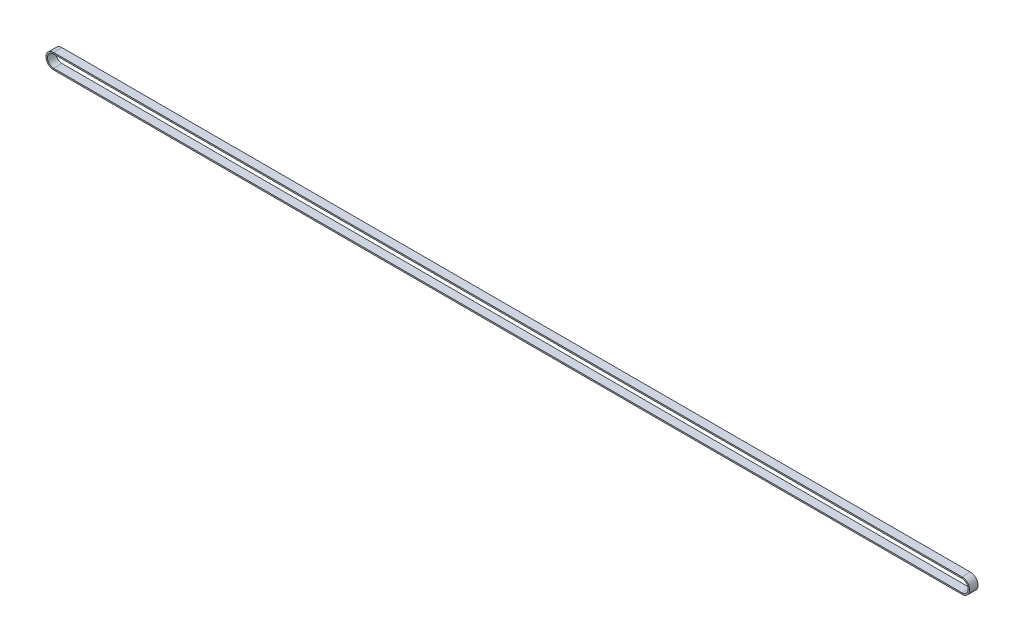
ISO-10303-21;
HEADER;
FILE_DESCRIPTION(('STEP AP214'),'2;1');
FILE_NAME('part.step','',(''),(''),'','','');
FILE_SCHEMA(('AUTOMOTIVE_DESIGN { 1 0 10303 214 1 1 1 1 }'));
ENDSEC;
DATA;
#1=APPLICATION_CONTEXT('core data for automotive mechanical design processes');
#2=APPLICATION_PROTOCOL_DEFINITION('international standard','automotive_design',2000,#1);
#3=PRODUCT_CONTEXT('',#1,'mechanical');
#4=PRODUCT('Part','Part','',(#3));
#5=PRODUCT_RELATED_PRODUCT_CATEGORY('part','',(#4));
#6=PRODUCT_DEFINITION_FORMATION('','',#4);
#7=PRODUCT_DEFINITION_CONTEXT('part definition',#1,'design');
#8=PRODUCT_DEFINITION('design','',#6,#7);
#9=PRODUCT_DEFINITION_SHAPE('','',#8);
#10=(LENGTH_UNIT() NAMED_UNIT(*) SI_UNIT(.MILLI.,.METRE.));
#11=(NAMED_UNIT(*) PLANE_ANGLE_UNIT() SI_UNIT($,.RADIAN.));
#12=(NAMED_UNIT(*) SI_UNIT($,.STERADIAN.) SOLID_ANGLE_UNIT());
#13=UNCERTAINTY_MEASURE_WITH_UNIT(LENGTH_MEASURE(1.E-05),#10,'distance_accuracy_value','');
#14=(GEOMETRIC_REPRESENTATION_CONTEXT(3) GLOBAL_UNCERTAINTY_ASSIGNED_CONTEXT((#13)) GLOBAL_UNIT_ASSIGNED_CONTEXT((#10,
#11,#12)) REPRESENTATION_CONTEXT('',''));
#15=CARTESIAN_POINT('',(0.,0.,0.));
#16=DIRECTION('',(0.,0.,1.));
#17=DIRECTION('',(1.,0.,0.));
#18=AXIS2_PLACEMENT_3D('',#15,#16,#17);
#19=CARTESIAN_POINT('',(-343.463325094612,-1403.78313649822,0.));
#20=DIRECTION('',(0.,-1.,0.));
#21=DIRECTION('',(0.,0.,-1.));
#22=AXIS2_PLACEMENT_3D('',#19,#20,#21);
#23=PLANE('',#22);
#24=DIRECTION('',(1.,0.,0.));
#25=VECTOR('',#24,1.);
#26=CARTESIAN_POINT('',(-343.463325094612,-1403.78313649822,0.));
#27=LINE('',#26,#25);
#28=CARTESIAN_POINT('',(-343.463325094708,-1403.78313649826,0.));
#29=VERTEX_POINT('',#28);
#30=CARTESIAN_POINT('',(632.867575204299,-1403.78313649826,0.));
#31=VERTEX_POINT('',#30);
#32=EDGE_CURVE('E11',#29,#31,#27,.T.);
#33=ORIENTED_EDGE('',*,*,#32,.F.);
#34=DIRECTION('',(0.,0.,-1.));
#35=VECTOR('',#34,1.);
#36=CARTESIAN_POINT('',(-343.463325094708,-1403.78313649826,0.));
#37=LINE('',#36,#35);
#38=CARTESIAN_POINT('',(-343.463325094708,-1403.78313649826,-9.));
#39=VERTEX_POINT('',#38);
#40=EDGE_CURVE('E38',#29,#39,#37,.T.);
#41=ORIENTED_EDGE('',*,*,#40,.T.);
#42=DIRECTION('',(1.,0.,0.));
#43=VECTOR('',#42,1.);
#44=CARTESIAN_POINT('',(-343.463325094612,-1403.78313649822,-9.));
#45=LINE('',#44,#43);
#46=CARTESIAN_POINT('',(632.867575204299,-1403.78313649826,-9.));
#47=VERTEX_POINT('',#46);
#48=EDGE_CURVE('E123',#39,#47,#45,.T.);
#49=ORIENTED_EDGE('',*,*,#48,.T.);
#50=DIRECTION('',(0.,0.,-1.));
#51=VECTOR('',#50,1.);
#52=CARTESIAN_POINT('',(632.867575204299,-1403.78313649826,0.));
#53=LINE('',#52,#51);
#54=EDGE_CURVE('E126',#31,#47,#53,.T.);
#55=ORIENTED_EDGE('',*,*,#54,.F.);
#56=EDGE_LOOP('',(#33,#41,#49,#55));
#57=FACE_BOUND('',#56,.T.);
#58=ADVANCED_FACE('F35',(#57),#23,.T.);
#59=CARTESIAN_POINT('',(-343.463325094612,-1403.78313649822,0.));
#60=DIRECTION('',(0.,0.,1.));
#61=DIRECTION('',(1.,0.,0.));
#62=AXIS2_PLACEMENT_3D('',#59,#60,#61);
#63=PLANE('',#62);
#64=DIRECTION('',(1.,0.,0.));
#65=VECTOR('',#64,1.);
#66=CARTESIAN_POINT('',(-343.463325094612,-1402.28313649822,0.));
#67=LINE('',#66,#65);
#68=CARTESIAN_POINT('',(-343.463325094708,-1402.28313649826,0.));
#69=VERTEX_POINT('',#68);
#70=CARTESIAN_POINT('',(632.867575204299,-1402.28313649826,0.));
#71=VERTEX_POINT('',#70);
#72=EDGE_CURVE('E43',#69,#71,#67,.T.);
#73=ORIENTED_EDGE('',*,*,#72,.F.);
#74=DIRECTION('',(0.,-1.,0.));
#75=VECTOR('',#74,1.);
#76=CARTESIAN_POINT('',(-343.463325094708,-1403.78313649826,0.));
#77=LINE('',#76,#75);
#78=EDGE_CURVE('E193',#69,#29,#77,.T.);
#79=ORIENTED_EDGE('',*,*,#78,.T.);
#80=ORIENTED_EDGE('',*,*,#32,.T.);
#81=DIRECTION('',(0.,-1.,0.));
#82=VECTOR('',#81,1.);
#83=CARTESIAN_POINT('',(632.867575204299,-1403.78313649826,0.));
#84=LINE('',#83,#82);
#85=EDGE_CURVE('E151',#71,#31,#84,.T.);
#86=ORIENTED_EDGE('',*,*,#85,.F.);
#87=EDGE_LOOP('',(#73,#79,#80,#86));
#88=FACE_BOUND('',#87,.T.);
#89=ADVANCED_FACE('F217',(#88),#63,.T.);
#90=CARTESIAN_POINT('',(-343.463325094612,-1402.28313649822,0.));
#91=DIRECTION('',(0.,1.,0.));
#92=DIRECTION('',(0.,0.,1.));
#93=AXIS2_PLACEMENT_3D('',#90,#91,#92);
#94=PLANE('',#93);
#95=DIRECTION('',(1.,0.,0.));
#96=VECTOR('',#95,1.);
#97=CARTESIAN_POINT('',(-343.463325094612,-1402.28313649822,-9.));
#98=LINE('',#97,#96);
#99=CARTESIAN_POINT('',(-343.463325094708,-1402.28313649826,-9.));
#100=VERTEX_POINT('',#99);
#101=CARTESIAN_POINT('',(632.867575204299,-1402.28313649826,-9.));
#102=VERTEX_POINT('',#101);
#103=EDGE_CURVE('E132',#100,#102,#98,.T.);
#104=ORIENTED_EDGE('',*,*,#103,.F.);
#105=DIRECTION('',(0.,0.,1.));
#106=VECTOR('',#105,1.);
#107=CARTESIAN_POINT('',(-343.463325094708,-1402.28313649826,0.));
#108=LINE('',#107,#106);
#109=EDGE_CURVE('E177',#100,#69,#108,.T.);
#110=ORIENTED_EDGE('',*,*,#109,.T.);
#111=ORIENTED_EDGE('',*,*,#72,.T.);
#112=DIRECTION('',(0.,0.,1.));
#113=VECTOR('',#112,1.);
#114=CARTESIAN_POINT('',(632.867575204299,-1402.28313649826,0.));
#115=LINE('',#114,#113);
#116=EDGE_CURVE('E155',#102,#71,#115,.T.);
#117=ORIENTED_EDGE('',*,*,#116,.F.);
#118=EDGE_LOOP('',(#104,#110,#111,#117));
#119=FACE_BOUND('',#118,.T.);
#120=ADVANCED_FACE('F222',(#119),#94,.T.);
#121=CARTESIAN_POINT('',(-343.463325094707,-1410.42288649826,0.));
#122=DIRECTION('',(0.,0.,-1.));
#123=DIRECTION('',(-1.,0.,0.));
#124=AXIS2_PLACEMENT_3D('',#121,#122,#123);
#125=CYLINDRICAL_SURFACE('',#124,6.63974999999994);
#126=ORIENTED_EDGE('',*,*,#40,.F.);
#127=CARTESIAN_POINT('',(-343.463325094707,-1410.42288649826,0.));
#128=DIRECTION('',(0.,0.,-1.));
#129=DIRECTION('',(0.,-1.,0.));
#130=AXIS2_PLACEMENT_3D('',#127,#128,#129);
#131=CIRCLE('',#130,6.63974999999994);
#132=CARTESIAN_POINT('',(-343.463325094707,-1417.06263649826,0.));
#133=VERTEX_POINT('',#132);
#134=EDGE_CURVE('E79',#133,#29,#131,.T.);
#135=ORIENTED_EDGE('',*,*,#134,.F.);
#136=DIRECTION('',(0.,0.,-1.));
#137=VECTOR('',#136,1.);
#138=CARTESIAN_POINT('',(-343.463325094707,-1417.06263649826,0.));
#139=LINE('',#138,#137);
#140=CARTESIAN_POINT('',(-343.463325094707,-1417.06263649826,-9.));
#141=VERTEX_POINT('',#140);
#142=EDGE_CURVE('E180',#133,#141,#139,.T.);
#143=ORIENTED_EDGE('',*,*,#142,.T.);
#144=CARTESIAN_POINT('',(-343.463325094707,-1410.42288649826,-9.));
#145=DIRECTION('',(0.,0.,-1.));
#146=DIRECTION('',(0.,-1.,0.));
#147=AXIS2_PLACEMENT_3D('',#144,#145,#146);
#148=CIRCLE('',#147,6.63974999999994);
#149=EDGE_CURVE('E175',#141,#39,#148,.T.);
#150=ORIENTED_EDGE('',*,*,#149,.T.);
#151=EDGE_LOOP('',(#126,#135,#143,#150));
#152=FACE_BOUND('',#151,.T.);
#153=ADVANCED_FACE('F206',(#152),#125,.F.);
#154=CARTESIAN_POINT('',(-343.463325094707,-1417.06263649826,0.));
#155=DIRECTION('',(0.,0.,1.));
#156=DIRECTION('',(1.,0.,0.));
#157=AXIS2_PLACEMENT_3D('',#154,#155,#156);
#158=PLANE('',#157);
#159=ORIENTED_EDGE('',*,*,#134,.T.);
#160=ORIENTED_EDGE('',*,*,#78,.F.);
#161=CARTESIAN_POINT('',(-343.463325094707,-1410.42288649826,0.));
#162=DIRECTION('',(0.,0.,-1.));
#163=DIRECTION('',(0.,-1.,0.));
#164=AXIS2_PLACEMENT_3D('',#161,#162,#163);
#165=CIRCLE('',#164,8.13975);
#166=CARTESIAN_POINT('',(-343.463325094707,-1418.56263649826,0.));
#167=VERTEX_POINT('',#166);
#168=EDGE_CURVE('E88',#167,#69,#165,.T.);
#169=ORIENTED_EDGE('',*,*,#168,.F.);
#170=DIRECTION('',(0.,1.,0.));
#171=VECTOR('',#170,1.);
#172=CARTESIAN_POINT('',(-343.463325094707,-1417.06263649826,0.));
#173=LINE('',#172,#171);
#174=EDGE_CURVE('E189',#167,#133,#173,.T.);
#175=ORIENTED_EDGE('',*,*,#174,.T.);
#176=EDGE_LOOP('',(#159,#160,#169,#175));
#177=FACE_BOUND('',#176,.T.);
#178=ADVANCED_FACE('F216',(#177),#158,.T.);
#179=CARTESIAN_POINT('',(-343.463325094707,-1410.42288649826,0.));
#180=DIRECTION('',(0.,0.,-1.));
#181=DIRECTION('',(-1.,0.,0.));
#182=AXIS2_PLACEMENT_3D('',#179,#180,#181);
#183=CYLINDRICAL_SURFACE('',#182,8.13975);
#184=ORIENTED_EDGE('',*,*,#168,.T.);
#185=ORIENTED_EDGE('',*,*,#109,.F.);
#186=CARTESIAN_POINT('',(-343.463325094707,-1410.42288649826,-9.));
#187=DIRECTION('',(0.,0.,-1.));
#188=DIRECTION('',(0.,-1.,0.));
#189=AXIS2_PLACEMENT_3D('',#186,#187,#188);
#190=CIRCLE('',#189,8.13975);
#191=CARTESIAN_POINT('',(-343.463325094707,-1418.56263649826,-9.));
#192=VERTEX_POINT('',#191);
#193=EDGE_CURVE('E96',#192,#100,#190,.T.);
#194=ORIENTED_EDGE('',*,*,#193,.F.);
#195=DIRECTION('',(0.,0.,1.));
#196=VECTOR('',#195,1.);
#197=CARTESIAN_POINT('',(-343.463325094707,-1418.56263649826,0.));
#198=LINE('',#197,#196);
#199=EDGE_CURVE('E169',#192,#167,#198,.T.);
#200=ORIENTED_EDGE('',*,*,#199,.T.);
#201=EDGE_LOOP('',(#184,#185,#194,#200));
#202=FACE_BOUND('',#201,.T.);
#203=ADVANCED_FACE('F223',(#202),#183,.T.);
#204=CARTESIAN_POINT('',(-343.463325094707,-1417.06263649826,-9.));
#205=DIRECTION('',(0.,0.,-1.));
#206=DIRECTION('',(-1.,0.,0.));
#207=AXIS2_PLACEMENT_3D('',#204,#205,#206);
#208=PLANE('',#207);
#209=ORIENTED_EDGE('',*,*,#193,.T.);
#210=DIRECTION('',(0.,1.,0.));
#211=VECTOR('',#210,1.);
#212=CARTESIAN_POINT('',(-343.463325094708,-1403.78313649826,-9.));
#213=LINE('',#212,#211);
#214=EDGE_CURVE('E173',#39,#100,#213,.T.);
#215=ORIENTED_EDGE('',*,*,#214,.F.);
#216=ORIENTED_EDGE('',*,*,#149,.F.);
#217=DIRECTION('',(0.,-1.,0.));
#218=VECTOR('',#217,1.);
#219=CARTESIAN_POINT('',(-343.463325094707,-1417.06263649826,-9.));
#220=LINE('',#219,#218);
#221=EDGE_CURVE('E164',#141,#192,#220,.T.);
#222=ORIENTED_EDGE('',*,*,#221,.T.);
#223=EDGE_LOOP('',(#209,#215,#216,#222));
#224=FACE_BOUND('',#223,.T.);
#225=ADVANCED_FACE('F224',(#224),#208,.T.);
#226=CARTESIAN_POINT('',(632.8675752043,-1417.06263649826,0.));
#227=DIRECTION('',(0.,1.,0.));
#228=DIRECTION('',(0.,0.,1.));
#229=AXIS2_PLACEMENT_3D('',#226,#227,#228);
#230=PLANE('',#229);
#231=ORIENTED_EDGE('',*,*,#142,.F.);
#232=DIRECTION('',(-1.,0.,0.));
#233=VECTOR('',#232,1.);
#234=CARTESIAN_POINT('',(632.8675752043,-1417.06263649826,0.));
#235=LINE('',#234,#233);
#236=CARTESIAN_POINT('',(632.8675752043,-1417.06263649826,0.));
#237=VERTEX_POINT('',#236);
#238=EDGE_CURVE('E199',#237,#133,#235,.T.);
#239=ORIENTED_EDGE('',*,*,#238,.F.);
#240=DIRECTION('',(0.,0.,-1.));
#241=VECTOR('',#240,1.);
#242=CARTESIAN_POINT('',(632.8675752043,-1417.06263649826,0.));
#243=LINE('',#242,#241);
#244=CARTESIAN_POINT('',(632.8675752043,-1417.06263649826,-9.));
#245=VERTEX_POINT('',#244);
#246=EDGE_CURVE('E172',#237,#245,#243,.T.);
#247=ORIENTED_EDGE('',*,*,#246,.T.);
#248=DIRECTION('',(-1.,0.,0.));
#249=VECTOR('',#248,1.);
#250=CARTESIAN_POINT('',(632.8675752043,-1417.06263649826,-9.));
#251=LINE('',#250,#249);
#252=EDGE_CURVE('E167',#245,#141,#251,.T.);
#253=ORIENTED_EDGE('',*,*,#252,.T.);
#254=EDGE_LOOP('',(#231,#239,#247,#253));
#255=FACE_BOUND('',#254,.T.);
#256=ADVANCED_FACE('F211',(#255),#230,.T.);
#257=CARTESIAN_POINT('',(632.8675752043,-1417.06263649826,0.));
#258=DIRECTION('',(0.,0.,1.));
#259=DIRECTION('',(1.,0.,0.));
#260=AXIS2_PLACEMENT_3D('',#257,#258,#259);
#261=PLANE('',#260);
#262=ORIENTED_EDGE('',*,*,#238,.T.);
#263=ORIENTED_EDGE('',*,*,#174,.F.);
#264=DIRECTION('',(-1.,0.,0.));
#265=VECTOR('',#264,1.);
#266=CARTESIAN_POINT('',(632.8675752043,-1418.56263649826,0.));
#267=LINE('',#266,#265);
#268=CARTESIAN_POINT('',(632.8675752043,-1418.56263649826,0.));
#269=VERTEX_POINT('',#268);
#270=EDGE_CURVE('E108',#269,#167,#267,.T.);
#271=ORIENTED_EDGE('',*,*,#270,.F.);
#272=DIRECTION('',(0.,1.,0.));
#273=VECTOR('',#272,1.);
#274=CARTESIAN_POINT('',(632.8675752043,-1417.06263649826,0.));
#275=LINE('',#274,#273);
#276=EDGE_CURVE('E186',#269,#237,#275,.T.);
#277=ORIENTED_EDGE('',*,*,#276,.T.);
#278=EDGE_LOOP('',(#262,#263,#271,#277));
#279=FACE_BOUND('',#278,.T.);
#280=ADVANCED_FACE('F215',(#279),#261,.T.);
#281=CARTESIAN_POINT('',(632.8675752043,-1418.56263649826,0.));
#282=DIRECTION('',(0.,-1.,0.));
#283=DIRECTION('',(0.,0.,-1.));
#284=AXIS2_PLACEMENT_3D('',#281,#282,#283);
#285=PLANE('',#284);
#286=ORIENTED_EDGE('',*,*,#270,.T.);
#287=ORIENTED_EDGE('',*,*,#199,.F.);
#288=DIRECTION('',(-1.,0.,0.));
#289=VECTOR('',#288,1.);
#290=CARTESIAN_POINT('',(632.8675752043,-1418.56263649826,-9.));
#291=LINE('',#290,#289);
#292=CARTESIAN_POINT('',(632.8675752043,-1418.56263649826,-9.));
#293=VERTEX_POINT('',#292);
#294=EDGE_CURVE('E114',#293,#192,#291,.T.);
#295=ORIENTED_EDGE('',*,*,#294,.F.);
#296=DIRECTION('',(0.,0.,1.));
#297=VECTOR('',#296,1.);
#298=CARTESIAN_POINT('',(632.8675752043,-1418.56263649826,0.));
#299=LINE('',#298,#297);
#300=EDGE_CURVE('E162',#293,#269,#299,.T.);
#301=ORIENTED_EDGE('',*,*,#300,.T.);
#302=EDGE_LOOP('',(#286,#287,#295,#301));
#303=FACE_BOUND('',#302,.T.);
#304=ADVANCED_FACE('F277',(#303),#285,.T.);
#305=CARTESIAN_POINT('',(632.8675752043,-1417.06263649826,-9.));
#306=DIRECTION('',(0.,0.,-1.));
#307=DIRECTION('',(-1.,0.,0.));
#308=AXIS2_PLACEMENT_3D('',#305,#306,#307);
#309=PLANE('',#308);
#310=ORIENTED_EDGE('',*,*,#294,.T.);
#311=ORIENTED_EDGE('',*,*,#221,.F.);
#312=ORIENTED_EDGE('',*,*,#252,.F.);
#313=DIRECTION('',(0.,-1.,0.));
#314=VECTOR('',#313,1.);
#315=CARTESIAN_POINT('',(632.8675752043,-1417.06263649826,-9.));
#316=LINE('',#315,#314);
#317=EDGE_CURVE('E143',#245,#293,#316,.T.);
#318=ORIENTED_EDGE('',*,*,#317,.T.);
#319=EDGE_LOOP('',(#310,#311,#312,#318));
#320=FACE_BOUND('',#319,.T.);
#321=ADVANCED_FACE('F209',(#320),#309,.T.);
#322=CARTESIAN_POINT('',(632.867575204299,-1410.42288649826,0.));
#323=DIRECTION('',(0.,0.,-1.));
#324=DIRECTION('',(-1.,0.,0.));
#325=AXIS2_PLACEMENT_3D('',#322,#323,#324);
#326=CYLINDRICAL_SURFACE('',#325,6.63974999999994);
#327=ORIENTED_EDGE('',*,*,#246,.F.);
#328=CARTESIAN_POINT('',(632.867575204299,-1410.42288649826,0.));
#329=DIRECTION('',(0.,0.,-1.));
#330=DIRECTION('',(0.,1.,0.));
#331=AXIS2_PLACEMENT_3D('',#328,#329,#330);
#332=CIRCLE('',#331,6.63974999999994);
#333=EDGE_CURVE('E150',#31,#237,#332,.T.);
#334=ORIENTED_EDGE('',*,*,#333,.F.);
#335=ORIENTED_EDGE('',*,*,#54,.T.);
#336=CARTESIAN_POINT('',(632.867575204299,-1410.42288649826,-9.));
#337=DIRECTION('',(0.,0.,-1.));
#338=DIRECTION('',(0.,1.,0.));
#339=AXIS2_PLACEMENT_3D('',#336,#337,#338);
#340=CIRCLE('',#339,6.63974999999994);
#341=EDGE_CURVE('E138',#47,#245,#340,.T.);
#342=ORIENTED_EDGE('',*,*,#341,.T.);
#343=EDGE_LOOP('',(#327,#334,#335,#342));
#344=FACE_BOUND('',#343,.T.);
#345=ADVANCED_FACE('F148',(#344),#326,.F.);
#346=CARTESIAN_POINT('',(632.867575204299,-1403.78313649826,0.));
#347=DIRECTION('',(0.,0.,1.));
#348=DIRECTION('',(1.,0.,0.));
#349=AXIS2_PLACEMENT_3D('',#346,#347,#348);
#350=PLANE('',#349);
#351=ORIENTED_EDGE('',*,*,#333,.T.);
#352=ORIENTED_EDGE('',*,*,#276,.F.);
#353=CARTESIAN_POINT('',(632.867575204299,-1410.42288649826,0.));
#354=DIRECTION('',(0.,0.,-1.));
#355=DIRECTION('',(0.,1.,0.));
#356=AXIS2_PLACEMENT_3D('',#353,#354,#355);
#357=CIRCLE('',#356,8.13975);
#358=EDGE_CURVE('E183',#71,#269,#357,.T.);
#359=ORIENTED_EDGE('',*,*,#358,.F.);
#360=ORIENTED_EDGE('',*,*,#85,.T.);
#361=EDGE_LOOP('',(#351,#352,#359,#360));
#362=FACE_BOUND('',#361,.T.);
#363=ADVANCED_FACE('F213',(#362),#350,.T.);
#364=CARTESIAN_POINT('',(632.867575204299,-1410.42288649826,0.));
#365=DIRECTION('',(0.,0.,-1.));
#366=DIRECTION('',(-1.,0.,0.));
#367=AXIS2_PLACEMENT_3D('',#364,#365,#366);
#368=CYLINDRICAL_SURFACE('',#367,8.13975);
#369=ORIENTED_EDGE('',*,*,#358,.T.);
#370=ORIENTED_EDGE('',*,*,#300,.F.);
#371=CARTESIAN_POINT('',(632.867575204299,-1410.42288649826,-9.));
#372=DIRECTION('',(0.,0.,-1.));
#373=DIRECTION('',(0.,1.,0.));
#374=AXIS2_PLACEMENT_3D('',#371,#372,#373);
#375=CIRCLE('',#374,8.13975);
#376=EDGE_CURVE('E161',#102,#293,#375,.T.);
#377=ORIENTED_EDGE('',*,*,#376,.F.);
#378=ORIENTED_EDGE('',*,*,#116,.T.);
#379=EDGE_LOOP('',(#369,#370,#377,#378));
#380=FACE_BOUND('',#379,.T.);
#381=ADVANCED_FACE('F220',(#380),#368,.T.);
#382=CARTESIAN_POINT('',(632.867575204299,-1403.78313649826,-9.));
#383=DIRECTION('',(0.,0.,-1.));
#384=DIRECTION('',(-1.,0.,0.));
#385=AXIS2_PLACEMENT_3D('',#382,#383,#384);
#386=PLANE('',#385);
#387=ORIENTED_EDGE('',*,*,#376,.T.);
#388=ORIENTED_EDGE('',*,*,#317,.F.);
#389=ORIENTED_EDGE('',*,*,#341,.F.);
#390=DIRECTION('',(0.,1.,0.));
#391=VECTOR('',#390,1.);
#392=CARTESIAN_POINT('',(632.867575204299,-1403.78313649826,-9.));
#393=LINE('',#392,#391);
#394=EDGE_CURVE('E141',#47,#102,#393,.T.);
#395=ORIENTED_EDGE('',*,*,#394,.T.);
#396=EDGE_LOOP('',(#387,#388,#389,#395));
#397=FACE_BOUND('',#396,.T.);
#398=ADVANCED_FACE('F140',(#397),#386,.T.);
#399=CARTESIAN_POINT('',(-343.463325094612,-1403.78313649822,-9.));
#400=DIRECTION('',(0.,0.,-1.));
#401=DIRECTION('',(-1.,0.,0.));
#402=AXIS2_PLACEMENT_3D('',#399,#400,#401);
#403=PLANE('',#402);
#404=ORIENTED_EDGE('',*,*,#214,.T.);
#405=ORIENTED_EDGE('',*,*,#103,.T.);
#406=ORIENTED_EDGE('',*,*,#394,.F.);
#407=ORIENTED_EDGE('',*,*,#48,.F.);
#408=EDGE_LOOP('',(#404,#405,#406,#407));
#409=FACE_BOUND('',#408,.T.);
#410=ADVANCED_FACE('F153',(#409),#403,.T.);
#411=CLOSED_SHELL('',(#58,#89,#120,#153,#178,#203,#225,#256,#280,#304,#321,#345,#363,#381,#398,#410));
#412=MANIFOLD_SOLID_BREP('B2',#411);
#413=ADVANCED_BREP_SHAPE_REPRESENTATION('',(#18,#412),#14);
#414=SHAPE_DEFINITION_REPRESENTATION(#9,#413);
ENDSEC;
END-ISO-10303-21;
